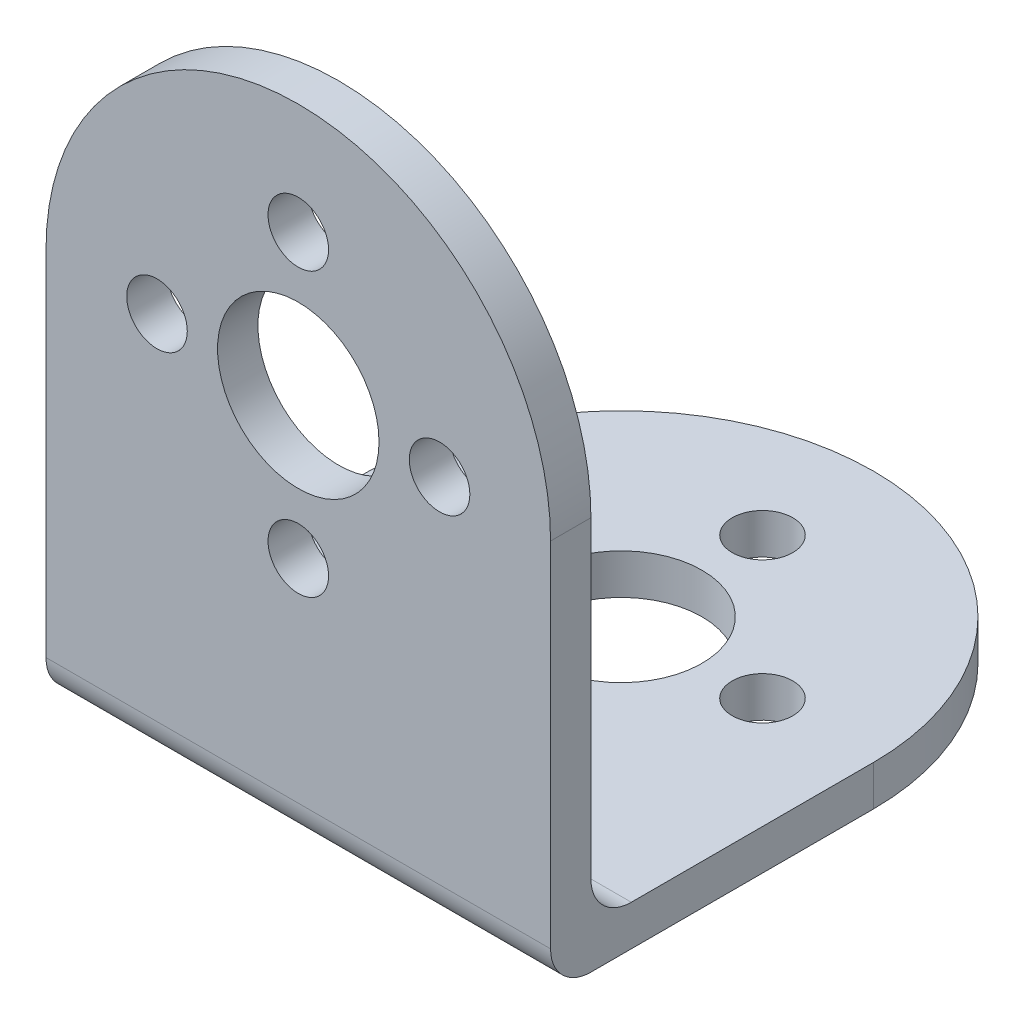
ISO-10303-21;
HEADER;
FILE_DESCRIPTION(('STEP AP214'),'2;1');
FILE_NAME('part.step','',(''),(''),'','','');
FILE_SCHEMA(('AUTOMOTIVE_DESIGN { 1 0 10303 214 1 1 1 1 }'));
ENDSEC;
DATA;
#1=APPLICATION_CONTEXT('core data for automotive mechanical design processes');
#2=APPLICATION_PROTOCOL_DEFINITION('international standard','automotive_design',2000,#1);
#3=PRODUCT_CONTEXT('',#1,'mechanical');
#4=PRODUCT('Part','Part','',(#3));
#5=PRODUCT_RELATED_PRODUCT_CATEGORY('part','',(#4));
#6=PRODUCT_DEFINITION_FORMATION('','',#4);
#7=PRODUCT_DEFINITION_CONTEXT('part definition',#1,'design');
#8=PRODUCT_DEFINITION('design','',#6,#7);
#9=PRODUCT_DEFINITION_SHAPE('','',#8);
#10=(LENGTH_UNIT() NAMED_UNIT(*) SI_UNIT(.MILLI.,.METRE.));
#11=(NAMED_UNIT(*) PLANE_ANGLE_UNIT() SI_UNIT($,.RADIAN.));
#12=(NAMED_UNIT(*) SI_UNIT($,.STERADIAN.) SOLID_ANGLE_UNIT());
#13=UNCERTAINTY_MEASURE_WITH_UNIT(LENGTH_MEASURE(1.E-05),#10,'distance_accuracy_value','');
#14=(GEOMETRIC_REPRESENTATION_CONTEXT(3) GLOBAL_UNCERTAINTY_ASSIGNED_CONTEXT((#13)) GLOBAL_UNIT_ASSIGNED_CONTEXT((#10,
#11,#12)) REPRESENTATION_CONTEXT('',''));
#15=CARTESIAN_POINT('',(0.,0.,0.));
#16=DIRECTION('',(0.,0.,1.));
#17=DIRECTION('',(1.,0.,0.));
#18=AXIS2_PLACEMENT_3D('',#15,#16,#17);
#19=CARTESIAN_POINT('',(0.,0.,-2.));
#20=DIRECTION('',(0.,0.,1.));
#21=DIRECTION('',(1.,0.,0.));
#22=AXIS2_PLACEMENT_3D('',#19,#20,#21);
#23=PLANE('',#22);
#24=CARTESIAN_POINT('',(0.,0.,-2.));
#25=DIRECTION('',(0.,0.,1.));
#26=DIRECTION('',(1.,0.,0.));
#27=AXIS2_PLACEMENT_3D('',#24,#25,#26);
#28=CIRCLE('',#27,4.);
#29=CARTESIAN_POINT('',(4.,0.,-2.));
#30=VERTEX_POINT('',#29);
#31=EDGE_CURVE('E162',#30,#30,#28,.T.);
#32=ORIENTED_EDGE('',*,*,#31,.T.);
#33=EDGE_LOOP('',(#32));
#34=FACE_BOUND('',#33,.T.);
#35=CARTESIAN_POINT('',(0.,7.,-2.));
#36=DIRECTION('',(0.,0.,1.));
#37=DIRECTION('',(1.,0.,0.));
#38=AXIS2_PLACEMENT_3D('',#35,#36,#37);
#39=CIRCLE('',#38,1.5);
#40=CARTESIAN_POINT('',(1.5,7.,-2.));
#41=VERTEX_POINT('',#40);
#42=EDGE_CURVE('E156',#41,#41,#39,.T.);
#43=ORIENTED_EDGE('',*,*,#42,.T.);
#44=EDGE_LOOP('',(#43));
#45=FACE_BOUND('',#44,.T.);
#46=CARTESIAN_POINT('',(7.,0.,-2.));
#47=DIRECTION('',(0.,0.,1.));
#48=DIRECTION('',(1.,0.,0.));
#49=AXIS2_PLACEMENT_3D('',#46,#47,#48);
#50=CIRCLE('',#49,1.5);
#51=CARTESIAN_POINT('',(8.5,0.,-2.));
#52=VERTEX_POINT('',#51);
#53=EDGE_CURVE('E150',#52,#52,#50,.T.);
#54=ORIENTED_EDGE('',*,*,#53,.T.);
#55=EDGE_LOOP('',(#54));
#56=FACE_BOUND('',#55,.T.);
#57=CARTESIAN_POINT('',(3.9618942650685E-13,-7.,-2.));
#58=DIRECTION('',(0.,0.,1.));
#59=DIRECTION('',(1.,0.,0.));
#60=AXIS2_PLACEMENT_3D('',#57,#58,#59);
#61=CIRCLE('',#60,1.50000000000043);
#62=CARTESIAN_POINT('',(1.50000000000082,-7.,-2.));
#63=VERTEX_POINT('',#62);
#64=EDGE_CURVE('E144',#63,#63,#61,.T.);
#65=ORIENTED_EDGE('',*,*,#64,.T.);
#66=EDGE_LOOP('',(#65));
#67=FACE_BOUND('',#66,.T.);
#68=CARTESIAN_POINT('',(-7.,0.,-2.));
#69=DIRECTION('',(0.,0.,1.));
#70=DIRECTION('',(1.,0.,0.));
#71=AXIS2_PLACEMENT_3D('',#68,#69,#70);
#72=CIRCLE('',#71,1.5);
#73=CARTESIAN_POINT('',(-5.5,0.,-2.));
#74=VERTEX_POINT('',#73);
#75=EDGE_CURVE('E138',#74,#74,#72,.T.);
#76=ORIENTED_EDGE('',*,*,#75,.T.);
#77=EDGE_LOOP('',(#76));
#78=FACE_BOUND('',#77,.T.);
#79=DIRECTION('',(0.,1.,0.));
#80=VECTOR('',#79,1.);
#81=CARTESIAN_POINT('',(12.5,-19.5,-2.));
#82=LINE('',#81,#80);
#83=CARTESIAN_POINT('',(12.5,-15.5,-2.));
#84=VERTEX_POINT('',#83);
#85=CARTESIAN_POINT('',(12.5,0.,-2.));
#86=VERTEX_POINT('',#85);
#87=EDGE_CURVE('E174',#84,#86,#82,.T.);
#88=ORIENTED_EDGE('',*,*,#87,.F.);
#89=DIRECTION('',(1.,0.,0.));
#90=VECTOR('',#89,1.);
#91=CARTESIAN_POINT('',(-12.5,-15.5,-2.));
#92=LINE('',#91,#90);
#93=CARTESIAN_POINT('',(-12.5,-15.5,-2.));
#94=VERTEX_POINT('',#93);
#95=EDGE_CURVE('E58',#84,#94,#92,.F.);
#96=ORIENTED_EDGE('',*,*,#95,.T.);
#97=DIRECTION('',(0.,-1.,0.));
#98=VECTOR('',#97,1.);
#99=CARTESIAN_POINT('',(-12.5,0.,-2.));
#100=LINE('',#99,#98);
#101=CARTESIAN_POINT('',(-12.5,0.,-2.));
#102=VERTEX_POINT('',#101);
#103=EDGE_CURVE('E171',#102,#94,#100,.T.);
#104=ORIENTED_EDGE('',*,*,#103,.F.);
#105=CARTESIAN_POINT('',(0.,0.,-2.));
#106=DIRECTION('',(0.,0.,1.));
#107=DIRECTION('',(1.,0.,0.));
#108=AXIS2_PLACEMENT_3D('',#105,#106,#107);
#109=CIRCLE('',#108,12.5);
#110=EDGE_CURVE('E168',#86,#102,#109,.T.);
#111=ORIENTED_EDGE('',*,*,#110,.F.);
#112=EDGE_LOOP('',(#88,#96,#104,#111));
#113=FACE_BOUND('',#112,.T.);
#114=ADVANCED_FACE('F37',(#34,#45,#56,#67,#78,#113),#23,.F.);
#115=CARTESIAN_POINT('',(0.,0.,-2.));
#116=DIRECTION('',(0.,0.,1.));
#117=DIRECTION('',(1.,0.,0.));
#118=AXIS2_PLACEMENT_3D('',#115,#116,#117);
#119=CYLINDRICAL_SURFACE('',#118,12.5);
#120=CARTESIAN_POINT('',(0.,0.,0.));
#121=DIRECTION('',(0.,0.,1.));
#122=DIRECTION('',(1.,0.,0.));
#123=AXIS2_PLACEMENT_3D('',#120,#121,#122);
#124=CIRCLE('',#123,12.5);
#125=CARTESIAN_POINT('',(12.5,0.,0.));
#126=VERTEX_POINT('',#125);
#127=CARTESIAN_POINT('',(-12.5,0.,0.));
#128=VERTEX_POINT('',#127);
#129=EDGE_CURVE('E165',#126,#128,#124,.T.);
#130=ORIENTED_EDGE('',*,*,#129,.F.);
#131=DIRECTION('',(0.,0.,1.));
#132=VECTOR('',#131,1.);
#133=CARTESIAN_POINT('',(12.5,0.,-2.));
#134=LINE('',#133,#132);
#135=EDGE_CURVE('E183',#86,#126,#134,.T.);
#136=ORIENTED_EDGE('',*,*,#135,.F.);
#137=ORIENTED_EDGE('',*,*,#110,.T.);
#138=DIRECTION('',(0.,0.,1.));
#139=VECTOR('',#138,1.);
#140=CARTESIAN_POINT('',(-12.5,0.,-2.));
#141=LINE('',#140,#139);
#142=EDGE_CURVE('E176',#102,#128,#141,.T.);
#143=ORIENTED_EDGE('',*,*,#142,.T.);
#144=EDGE_LOOP('',(#130,#136,#137,#143));
#145=FACE_BOUND('',#144,.T.);
#146=ADVANCED_FACE('F212',(#145),#119,.T.);
#147=CARTESIAN_POINT('',(12.5,-19.5,-2.));
#148=DIRECTION('',(1.,0.,0.));
#149=DIRECTION('',(0.,0.,-1.));
#150=AXIS2_PLACEMENT_3D('',#147,#148,#149);
#151=PLANE('',#150);
#152=DIRECTION('',(0.,1.,0.));
#153=VECTOR('',#152,1.);
#154=CARTESIAN_POINT('',(12.5,-19.5,0.));
#155=LINE('',#154,#153);
#156=CARTESIAN_POINT('',(12.5,-17.5,0.));
#157=VERTEX_POINT('',#156);
#158=EDGE_CURVE('E172',#157,#126,#155,.T.);
#159=ORIENTED_EDGE('',*,*,#158,.F.);
#160=CARTESIAN_POINT('',(12.5,-17.5,-2.));
#161=DIRECTION('',(1.,0.,0.));
#162=DIRECTION('',(0.,0.,-1.));
#163=AXIS2_PLACEMENT_3D('',#160,#161,#162);
#164=CIRCLE('',#163,2.);
#165=CARTESIAN_POINT('',(12.5,-19.5,-2.));
#166=VERTEX_POINT('',#165);
#167=EDGE_CURVE('E194',#157,#166,#164,.T.);
#168=ORIENTED_EDGE('',*,*,#167,.T.);
#169=DIRECTION('',(0.,0.,1.));
#170=VECTOR('',#169,1.);
#171=CARTESIAN_POINT('',(12.5,-19.5,-2.));
#172=LINE('',#171,#170);
#173=CARTESIAN_POINT('',(12.5,-19.5,-16.));
#174=VERTEX_POINT('',#173);
#175=EDGE_CURVE('E108',#174,#166,#172,.T.);
#176=ORIENTED_EDGE('',*,*,#175,.F.);
#177=DIRECTION('',(0.,-1.,0.));
#178=VECTOR('',#177,1.);
#179=CARTESIAN_POINT('',(12.5,-17.5,-16.));
#180=LINE('',#179,#178);
#181=CARTESIAN_POINT('',(12.5,-17.5,-16.));
#182=VERTEX_POINT('',#181);
#183=EDGE_CURVE('E102',#182,#174,#180,.T.);
#184=ORIENTED_EDGE('',*,*,#183,.F.);
#185=DIRECTION('',(0.,0.,1.));
#186=VECTOR('',#185,1.);
#187=CARTESIAN_POINT('',(12.5,-17.5,0.));
#188=LINE('',#187,#186);
#189=CARTESIAN_POINT('',(12.5,-17.5,-4.));
#190=VERTEX_POINT('',#189);
#191=EDGE_CURVE('E106',#182,#190,#188,.T.);
#192=ORIENTED_EDGE('',*,*,#191,.T.);
#193=CARTESIAN_POINT('',(12.5,-15.5,-4.));
#194=DIRECTION('',(1.,0.,0.));
#195=DIRECTION('',(0.,0.,-1.));
#196=AXIS2_PLACEMENT_3D('',#193,#194,#195);
#197=CIRCLE('',#196,2.);
#198=EDGE_CURVE('E45',#190,#84,#197,.F.);
#199=ORIENTED_EDGE('',*,*,#198,.T.);
#200=ORIENTED_EDGE('',*,*,#87,.T.);
#201=ORIENTED_EDGE('',*,*,#135,.T.);
#202=EDGE_LOOP('',(#159,#168,#176,#184,#192,#199,#200,#201));
#203=FACE_BOUND('',#202,.T.);
#204=ADVANCED_FACE('F105',(#203),#151,.T.);
#205=CARTESIAN_POINT('',(-12.5,-19.5,-2.));
#206=DIRECTION('',(0.,-1.,0.));
#207=DIRECTION('',(0.,0.,-1.));
#208=AXIS2_PLACEMENT_3D('',#205,#206,#207);
#209=PLANE('',#208);
#210=ORIENTED_EDGE('',*,*,#175,.T.);
#211=DIRECTION('',(1.,0.,0.));
#212=VECTOR('',#211,1.);
#213=CARTESIAN_POINT('',(-12.5,-19.5,-2.));
#214=LINE('',#213,#212);
#215=CARTESIAN_POINT('',(-12.5,-19.5,-2.));
#216=VERTEX_POINT('',#215);
#217=EDGE_CURVE('E196',#166,#216,#214,.F.);
#218=ORIENTED_EDGE('',*,*,#217,.T.);
#219=DIRECTION('',(0.,0.,1.));
#220=VECTOR('',#219,1.);
#221=CARTESIAN_POINT('',(-12.5,-19.5,-2.));
#222=LINE('',#221,#220);
#223=CARTESIAN_POINT('',(-12.5,-19.5,-16.));
#224=VERTEX_POINT('',#223);
#225=EDGE_CURVE('E188',#224,#216,#222,.T.);
#226=ORIENTED_EDGE('',*,*,#225,.F.);
#227=CARTESIAN_POINT('',(0.,-19.5,-16.));
#228=DIRECTION('',(0.,-1.,0.));
#229=DIRECTION('',(0.,0.,-1.));
#230=AXIS2_PLACEMENT_3D('',#227,#228,#229);
#231=CIRCLE('',#230,12.5);
#232=EDGE_CURVE('E127',#224,#174,#231,.T.);
#233=ORIENTED_EDGE('',*,*,#232,.T.);
#234=EDGE_LOOP('',(#210,#218,#226,#233));
#235=FACE_BOUND('',#234,.T.);
#236=CARTESIAN_POINT('',(0.,-19.5,-16.));
#237=DIRECTION('',(0.,-1.,0.));
#238=DIRECTION('',(0.,0.,-1.));
#239=AXIS2_PLACEMENT_3D('',#236,#237,#238);
#240=CIRCLE('',#239,4.);
#241=CARTESIAN_POINT('',(0.,-19.5,-20.));
#242=VERTEX_POINT('',#241);
#243=EDGE_CURVE('E132',#242,#242,#240,.T.);
#244=ORIENTED_EDGE('',*,*,#243,.F.);
#245=EDGE_LOOP('',(#244));
#246=FACE_BOUND('',#245,.T.);
#247=CARTESIAN_POINT('',(0.,-19.5,-9.));
#248=DIRECTION('',(0.,-1.,0.));
#249=DIRECTION('',(0.,0.,-1.));
#250=AXIS2_PLACEMENT_3D('',#247,#248,#249);
#251=CIRCLE('',#250,1.5);
#252=CARTESIAN_POINT('',(0.,-19.5,-10.5));
#253=VERTEX_POINT('',#252);
#254=EDGE_CURVE('E252',#253,#253,#251,.T.);
#255=ORIENTED_EDGE('',*,*,#254,.F.);
#256=EDGE_LOOP('',(#255));
#257=FACE_BOUND('',#256,.T.);
#258=CARTESIAN_POINT('',(7.0000000000001,-19.5,-15.9999999999999));
#259=DIRECTION('',(0.,-1.,0.));
#260=DIRECTION('',(0.,0.,-1.));
#261=AXIS2_PLACEMENT_3D('',#258,#259,#260);
#262=CIRCLE('',#261,1.5);
#263=CARTESIAN_POINT('',(7.0000000000001,-19.5,-17.4999999999999));
#264=VERTEX_POINT('',#263);
#265=EDGE_CURVE('E256',#264,#264,#262,.T.);
#266=ORIENTED_EDGE('',*,*,#265,.F.);
#267=EDGE_LOOP('',(#266));
#268=FACE_BOUND('',#267,.T.);
#269=CARTESIAN_POINT('',(1.49234192466792E-13,-19.5,-23.));
#270=DIRECTION('',(0.,-1.,0.));
#271=DIRECTION('',(0.,0.,-1.));
#272=AXIS2_PLACEMENT_3D('',#269,#270,#271);
#273=CIRCLE('',#272,1.5);
#274=CARTESIAN_POINT('',(1.49234192466792E-13,-19.5,-24.5));
#275=VERTEX_POINT('',#274);
#276=EDGE_CURVE('E260',#275,#275,#273,.T.);
#277=ORIENTED_EDGE('',*,*,#276,.F.);
#278=EDGE_LOOP('',(#277));
#279=FACE_BOUND('',#278,.T.);
#280=CARTESIAN_POINT('',(-6.9999999999999,-19.5,-16.));
#281=DIRECTION('',(0.,-1.,0.));
#282=DIRECTION('',(0.,0.,-1.));
#283=AXIS2_PLACEMENT_3D('',#280,#281,#282);
#284=CIRCLE('',#283,1.5);
#285=CARTESIAN_POINT('',(-6.9999999999999,-19.5,-17.5));
#286=VERTEX_POINT('',#285);
#287=EDGE_CURVE('E263',#286,#286,#284,.T.);
#288=ORIENTED_EDGE('',*,*,#287,.F.);
#289=EDGE_LOOP('',(#288));
#290=FACE_BOUND('',#289,.T.);
#291=ADVANCED_FACE('F232',(#235,#246,#257,#268,#279,#290),#209,.T.);
#292=CARTESIAN_POINT('',(-12.5,0.,-2.));
#293=DIRECTION('',(-1.,0.,0.));
#294=DIRECTION('',(0.,0.,1.));
#295=AXIS2_PLACEMENT_3D('',#292,#293,#294);
#296=PLANE('',#295);
#297=ORIENTED_EDGE('',*,*,#225,.T.);
#298=CARTESIAN_POINT('',(-12.5,-17.5,-2.));
#299=DIRECTION('',(-1.,0.,0.));
#300=DIRECTION('',(0.,0.,1.));
#301=AXIS2_PLACEMENT_3D('',#298,#299,#300);
#302=CIRCLE('',#301,2.);
#303=CARTESIAN_POINT('',(-12.5,-17.5,0.));
#304=VERTEX_POINT('',#303);
#305=EDGE_CURVE('E198',#216,#304,#302,.T.);
#306=ORIENTED_EDGE('',*,*,#305,.T.);
#307=DIRECTION('',(0.,-1.,0.));
#308=VECTOR('',#307,1.);
#309=CARTESIAN_POINT('',(-12.5,0.,0.));
#310=LINE('',#309,#308);
#311=EDGE_CURVE('E179',#128,#304,#310,.T.);
#312=ORIENTED_EDGE('',*,*,#311,.F.);
#313=ORIENTED_EDGE('',*,*,#142,.F.);
#314=ORIENTED_EDGE('',*,*,#103,.T.);
#315=CARTESIAN_POINT('',(-12.5,-15.5,-4.));
#316=DIRECTION('',(-1.,0.,0.));
#317=DIRECTION('',(0.,0.,1.));
#318=AXIS2_PLACEMENT_3D('',#315,#316,#317);
#319=CIRCLE('',#318,2.);
#320=CARTESIAN_POINT('',(-12.5,-17.5,-4.));
#321=VERTEX_POINT('',#320);
#322=EDGE_CURVE('E11',#94,#321,#319,.F.);
#323=ORIENTED_EDGE('',*,*,#322,.T.);
#324=DIRECTION('',(0.,0.,-1.));
#325=VECTOR('',#324,1.);
#326=CARTESIAN_POINT('',(-12.5,-17.5,-16.));
#327=LINE('',#326,#325);
#328=CARTESIAN_POINT('',(-12.5,-17.5,-16.));
#329=VERTEX_POINT('',#328);
#330=EDGE_CURVE('E114',#321,#329,#327,.T.);
#331=ORIENTED_EDGE('',*,*,#330,.T.);
#332=DIRECTION('',(0.,-1.,0.));
#333=VECTOR('',#332,1.);
#334=CARTESIAN_POINT('',(-12.5,-17.5,-16.));
#335=LINE('',#334,#333);
#336=EDGE_CURVE('E113',#329,#224,#335,.T.);
#337=ORIENTED_EDGE('',*,*,#336,.T.);
#338=EDGE_LOOP('',(#297,#306,#312,#313,#314,#323,#331,#337));
#339=FACE_BOUND('',#338,.T.);
#340=ADVANCED_FACE('F228',(#339),#296,.T.);
#341=CARTESIAN_POINT('',(0.,0.,0.));
#342=DIRECTION('',(0.,0.,1.));
#343=DIRECTION('',(1.,0.,0.));
#344=AXIS2_PLACEMENT_3D('',#341,#342,#343);
#345=PLANE('',#344);
#346=ORIENTED_EDGE('',*,*,#311,.T.);
#347=DIRECTION('',(1.,0.,0.));
#348=VECTOR('',#347,1.);
#349=CARTESIAN_POINT('',(0.,-17.5,0.));
#350=LINE('',#349,#348);
#351=EDGE_CURVE('E186',#304,#157,#350,.T.);
#352=ORIENTED_EDGE('',*,*,#351,.T.);
#353=ORIENTED_EDGE('',*,*,#158,.T.);
#354=ORIENTED_EDGE('',*,*,#129,.T.);
#355=EDGE_LOOP('',(#346,#352,#353,#354));
#356=FACE_BOUND('',#355,.T.);
#357=CARTESIAN_POINT('',(-7.,0.,0.));
#358=DIRECTION('',(0.,0.,1.));
#359=DIRECTION('',(1.,0.,0.));
#360=AXIS2_PLACEMENT_3D('',#357,#358,#359);
#361=CIRCLE('',#360,1.5);
#362=CARTESIAN_POINT('',(-5.5,0.,0.));
#363=VERTEX_POINT('',#362);
#364=EDGE_CURVE('E136',#363,#363,#361,.T.);
#365=ORIENTED_EDGE('',*,*,#364,.F.);
#366=EDGE_LOOP('',(#365));
#367=FACE_BOUND('',#366,.T.);
#368=CARTESIAN_POINT('',(3.9618942650685E-13,-7.,0.));
#369=DIRECTION('',(0.,0.,1.));
#370=DIRECTION('',(1.,0.,0.));
#371=AXIS2_PLACEMENT_3D('',#368,#369,#370);
#372=CIRCLE('',#371,1.50000000000043);
#373=CARTESIAN_POINT('',(1.50000000000082,-7.,0.));
#374=VERTEX_POINT('',#373);
#375=EDGE_CURVE('E141',#374,#374,#372,.T.);
#376=ORIENTED_EDGE('',*,*,#375,.F.);
#377=EDGE_LOOP('',(#376));
#378=FACE_BOUND('',#377,.T.);
#379=CARTESIAN_POINT('',(7.,0.,0.));
#380=DIRECTION('',(0.,0.,1.));
#381=DIRECTION('',(1.,0.,0.));
#382=AXIS2_PLACEMENT_3D('',#379,#380,#381);
#383=CIRCLE('',#382,1.5);
#384=CARTESIAN_POINT('',(8.5,0.,0.));
#385=VERTEX_POINT('',#384);
#386=EDGE_CURVE('E147',#385,#385,#383,.T.);
#387=ORIENTED_EDGE('',*,*,#386,.F.);
#388=EDGE_LOOP('',(#387));
#389=FACE_BOUND('',#388,.T.);
#390=CARTESIAN_POINT('',(0.,7.,0.));
#391=DIRECTION('',(0.,0.,1.));
#392=DIRECTION('',(1.,0.,0.));
#393=AXIS2_PLACEMENT_3D('',#390,#391,#392);
#394=CIRCLE('',#393,1.5);
#395=CARTESIAN_POINT('',(1.5,7.,0.));
#396=VERTEX_POINT('',#395);
#397=EDGE_CURVE('E153',#396,#396,#394,.T.);
#398=ORIENTED_EDGE('',*,*,#397,.F.);
#399=EDGE_LOOP('',(#398));
#400=FACE_BOUND('',#399,.T.);
#401=CARTESIAN_POINT('',(0.,0.,0.));
#402=DIRECTION('',(0.,0.,1.));
#403=DIRECTION('',(1.,0.,0.));
#404=AXIS2_PLACEMENT_3D('',#401,#402,#403);
#405=CIRCLE('',#404,4.);
#406=CARTESIAN_POINT('',(4.,0.,0.));
#407=VERTEX_POINT('',#406);
#408=EDGE_CURVE('E159',#407,#407,#405,.T.);
#409=ORIENTED_EDGE('',*,*,#408,.F.);
#410=EDGE_LOOP('',(#409));
#411=FACE_BOUND('',#410,.T.);
#412=ADVANCED_FACE('F225',(#356,#367,#378,#389,#400,#411),#345,.T.);
#413=CARTESIAN_POINT('',(0.,0.,-2.));
#414=DIRECTION('',(0.,0.,1.));
#415=DIRECTION('',(1.,0.,0.));
#416=AXIS2_PLACEMENT_3D('',#413,#414,#415);
#417=CYLINDRICAL_SURFACE('',#416,4.);
#418=ORIENTED_EDGE('',*,*,#31,.F.);
#419=EDGE_LOOP('',(#418));
#420=FACE_BOUND('',#419,.T.);
#421=ORIENTED_EDGE('',*,*,#408,.T.);
#422=EDGE_LOOP('',(#421));
#423=FACE_BOUND('',#422,.T.);
#424=ADVANCED_FACE('F223',(#420,#423),#417,.F.);
#425=CARTESIAN_POINT('',(0.,7.,-2.));
#426=DIRECTION('',(0.,0.,1.));
#427=DIRECTION('',(1.,0.,0.));
#428=AXIS2_PLACEMENT_3D('',#425,#426,#427);
#429=CYLINDRICAL_SURFACE('',#428,1.5);
#430=ORIENTED_EDGE('',*,*,#42,.F.);
#431=EDGE_LOOP('',(#430));
#432=FACE_BOUND('',#431,.T.);
#433=ORIENTED_EDGE('',*,*,#397,.T.);
#434=EDGE_LOOP('',(#433));
#435=FACE_BOUND('',#434,.T.);
#436=ADVANCED_FACE('F313',(#432,#435),#429,.F.);
#437=CARTESIAN_POINT('',(7.,0.,-2.));
#438=DIRECTION('',(0.,0.,1.));
#439=DIRECTION('',(1.,0.,0.));
#440=AXIS2_PLACEMENT_3D('',#437,#438,#439);
#441=CYLINDRICAL_SURFACE('',#440,1.5);
#442=ORIENTED_EDGE('',*,*,#53,.F.);
#443=EDGE_LOOP('',(#442));
#444=FACE_BOUND('',#443,.T.);
#445=ORIENTED_EDGE('',*,*,#386,.T.);
#446=EDGE_LOOP('',(#445));
#447=FACE_BOUND('',#446,.T.);
#448=ADVANCED_FACE('F310',(#444,#447),#441,.F.);
#449=CARTESIAN_POINT('',(3.9618942650685E-13,-7.,-2.));
#450=DIRECTION('',(0.,0.,1.));
#451=DIRECTION('',(1.,0.,0.));
#452=AXIS2_PLACEMENT_3D('',#449,#450,#451);
#453=CYLINDRICAL_SURFACE('',#452,1.50000000000043);
#454=ORIENTED_EDGE('',*,*,#64,.F.);
#455=EDGE_LOOP('',(#454));
#456=FACE_BOUND('',#455,.T.);
#457=ORIENTED_EDGE('',*,*,#375,.T.);
#458=EDGE_LOOP('',(#457));
#459=FACE_BOUND('',#458,.T.);
#460=ADVANCED_FACE('F306',(#456,#459),#453,.F.);
#461=CARTESIAN_POINT('',(-7.,0.,-2.));
#462=DIRECTION('',(0.,0.,1.));
#463=DIRECTION('',(1.,0.,0.));
#464=AXIS2_PLACEMENT_3D('',#461,#462,#463);
#465=CYLINDRICAL_SURFACE('',#464,1.5);
#466=ORIENTED_EDGE('',*,*,#75,.F.);
#467=EDGE_LOOP('',(#466));
#468=FACE_BOUND('',#467,.T.);
#469=ORIENTED_EDGE('',*,*,#364,.T.);
#470=EDGE_LOOP('',(#469));
#471=FACE_BOUND('',#470,.T.);
#472=ADVANCED_FACE('F301',(#468,#471),#465,.F.);
#473=CARTESIAN_POINT('',(0.,-17.5,-16.));
#474=DIRECTION('',(0.,-1.,0.));
#475=DIRECTION('',(0.,0.,-1.));
#476=AXIS2_PLACEMENT_3D('',#473,#474,#475);
#477=PLANE('',#476);
#478=CARTESIAN_POINT('',(-6.9999999999999,-17.5,-16.));
#479=DIRECTION('',(0.,-1.,0.));
#480=DIRECTION('',(0.,0.,-1.));
#481=AXIS2_PLACEMENT_3D('',#478,#479,#480);
#482=CIRCLE('',#481,1.5);
#483=CARTESIAN_POINT('',(-6.9999999999999,-17.5,-17.5));
#484=VERTEX_POINT('',#483);
#485=EDGE_CURVE('E265',#484,#484,#482,.T.);
#486=ORIENTED_EDGE('',*,*,#485,.T.);
#487=EDGE_LOOP('',(#486));
#488=FACE_BOUND('',#487,.T.);
#489=CARTESIAN_POINT('',(1.49234192466792E-13,-17.5,-23.));
#490=DIRECTION('',(0.,-1.,0.));
#491=DIRECTION('',(0.,0.,-1.));
#492=AXIS2_PLACEMENT_3D('',#489,#490,#491);
#493=CIRCLE('',#492,1.5);
#494=CARTESIAN_POINT('',(1.49234192466792E-13,-17.5,-24.5));
#495=VERTEX_POINT('',#494);
#496=EDGE_CURVE('E270',#495,#495,#493,.T.);
#497=ORIENTED_EDGE('',*,*,#496,.T.);
#498=EDGE_LOOP('',(#497));
#499=FACE_BOUND('',#498,.T.);
#500=CARTESIAN_POINT('',(7.0000000000001,-17.5,-15.9999999999999));
#501=DIRECTION('',(0.,-1.,0.));
#502=DIRECTION('',(0.,0.,-1.));
#503=AXIS2_PLACEMENT_3D('',#500,#501,#502);
#504=CIRCLE('',#503,1.5);
#505=CARTESIAN_POINT('',(7.0000000000001,-17.5,-17.4999999999999));
#506=VERTEX_POINT('',#505);
#507=EDGE_CURVE('E274',#506,#506,#504,.T.);
#508=ORIENTED_EDGE('',*,*,#507,.T.);
#509=EDGE_LOOP('',(#508));
#510=FACE_BOUND('',#509,.T.);
#511=CARTESIAN_POINT('',(0.,-17.5,-9.));
#512=DIRECTION('',(0.,-1.,0.));
#513=DIRECTION('',(0.,0.,-1.));
#514=AXIS2_PLACEMENT_3D('',#511,#512,#513);
#515=CIRCLE('',#514,1.5);
#516=CARTESIAN_POINT('',(0.,-17.5,-10.5));
#517=VERTEX_POINT('',#516);
#518=EDGE_CURVE('E278',#517,#517,#515,.T.);
#519=ORIENTED_EDGE('',*,*,#518,.T.);
#520=EDGE_LOOP('',(#519));
#521=FACE_BOUND('',#520,.T.);
#522=CARTESIAN_POINT('',(0.,-17.5,-16.));
#523=DIRECTION('',(0.,-1.,0.));
#524=DIRECTION('',(0.,0.,-1.));
#525=AXIS2_PLACEMENT_3D('',#522,#523,#524);
#526=CIRCLE('',#525,4.);
#527=CARTESIAN_POINT('',(0.,-17.5,-20.));
#528=VERTEX_POINT('',#527);
#529=EDGE_CURVE('E129',#528,#528,#526,.T.);
#530=ORIENTED_EDGE('',*,*,#529,.T.);
#531=EDGE_LOOP('',(#530));
#532=FACE_BOUND('',#531,.T.);
#533=ORIENTED_EDGE('',*,*,#330,.F.);
#534=DIRECTION('',(1.,0.,0.));
#535=VECTOR('',#534,1.);
#536=CARTESIAN_POINT('',(12.5,-17.5,-4.));
#537=LINE('',#536,#535);
#538=EDGE_CURVE('E122',#321,#190,#537,.T.);
#539=ORIENTED_EDGE('',*,*,#538,.T.);
#540=ORIENTED_EDGE('',*,*,#191,.F.);
#541=CARTESIAN_POINT('',(0.,-17.5,-16.));
#542=DIRECTION('',(0.,-1.,0.));
#543=DIRECTION('',(0.,0.,-1.));
#544=AXIS2_PLACEMENT_3D('',#541,#542,#543);
#545=CIRCLE('',#544,12.5);
#546=EDGE_CURVE('E120',#329,#182,#545,.T.);
#547=ORIENTED_EDGE('',*,*,#546,.F.);
#548=EDGE_LOOP('',(#533,#539,#540,#547));
#549=FACE_BOUND('',#548,.T.);
#550=ADVANCED_FACE('F119',(#488,#499,#510,#521,#532,#549),#477,.F.);
#551=CARTESIAN_POINT('',(0.,-17.5,-16.));
#552=DIRECTION('',(0.,-1.,0.));
#553=DIRECTION('',(0.,0.,-1.));
#554=AXIS2_PLACEMENT_3D('',#551,#552,#553);
#555=CYLINDRICAL_SURFACE('',#554,12.5);
#556=ORIENTED_EDGE('',*,*,#232,.F.);
#557=ORIENTED_EDGE('',*,*,#336,.F.);
#558=ORIENTED_EDGE('',*,*,#546,.T.);
#559=ORIENTED_EDGE('',*,*,#183,.T.);
#560=EDGE_LOOP('',(#556,#557,#558,#559));
#561=FACE_BOUND('',#560,.T.);
#562=ADVANCED_FACE('F125',(#561),#555,.T.);
#563=CARTESIAN_POINT('',(0.,-17.5,-16.));
#564=DIRECTION('',(0.,-1.,0.));
#565=DIRECTION('',(0.,0.,-1.));
#566=AXIS2_PLACEMENT_3D('',#563,#564,#565);
#567=CYLINDRICAL_SURFACE('',#566,4.);
#568=ORIENTED_EDGE('',*,*,#529,.F.);
#569=EDGE_LOOP('',(#568));
#570=FACE_BOUND('',#569,.T.);
#571=ORIENTED_EDGE('',*,*,#243,.T.);
#572=EDGE_LOOP('',(#571));
#573=FACE_BOUND('',#572,.T.);
#574=ADVANCED_FACE('F285',(#570,#573),#567,.F.);
#575=CARTESIAN_POINT('',(0.,-17.5,-9.));
#576=DIRECTION('',(0.,-1.,0.));
#577=DIRECTION('',(0.,0.,-1.));
#578=AXIS2_PLACEMENT_3D('',#575,#576,#577);
#579=CYLINDRICAL_SURFACE('',#578,1.5);
#580=ORIENTED_EDGE('',*,*,#518,.F.);
#581=EDGE_LOOP('',(#580));
#582=FACE_BOUND('',#581,.T.);
#583=ORIENTED_EDGE('',*,*,#254,.T.);
#584=EDGE_LOOP('',(#583));
#585=FACE_BOUND('',#584,.T.);
#586=ADVANCED_FACE('F287',(#582,#585),#579,.F.);
#587=CARTESIAN_POINT('',(7.0000000000001,-17.5,-15.9999999999999));
#588=DIRECTION('',(0.,-1.,0.));
#589=DIRECTION('',(0.,0.,-1.));
#590=AXIS2_PLACEMENT_3D('',#587,#588,#589);
#591=CYLINDRICAL_SURFACE('',#590,1.5);
#592=ORIENTED_EDGE('',*,*,#507,.F.);
#593=EDGE_LOOP('',(#592));
#594=FACE_BOUND('',#593,.T.);
#595=ORIENTED_EDGE('',*,*,#265,.T.);
#596=EDGE_LOOP('',(#595));
#597=FACE_BOUND('',#596,.T.);
#598=ADVANCED_FACE('F294',(#594,#597),#591,.F.);
#599=CARTESIAN_POINT('',(1.49234192466792E-13,-17.5,-23.));
#600=DIRECTION('',(0.,-1.,0.));
#601=DIRECTION('',(0.,0.,-1.));
#602=AXIS2_PLACEMENT_3D('',#599,#600,#601);
#603=CYLINDRICAL_SURFACE('',#602,1.5);
#604=ORIENTED_EDGE('',*,*,#496,.F.);
#605=EDGE_LOOP('',(#604));
#606=FACE_BOUND('',#605,.T.);
#607=ORIENTED_EDGE('',*,*,#276,.T.);
#608=EDGE_LOOP('',(#607));
#609=FACE_BOUND('',#608,.T.);
#610=ADVANCED_FACE('F380',(#606,#609),#603,.F.);
#611=CARTESIAN_POINT('',(-6.9999999999999,-17.5,-16.));
#612=DIRECTION('',(0.,-1.,0.));
#613=DIRECTION('',(0.,0.,-1.));
#614=AXIS2_PLACEMENT_3D('',#611,#612,#613);
#615=CYLINDRICAL_SURFACE('',#614,1.5);
#616=ORIENTED_EDGE('',*,*,#485,.F.);
#617=EDGE_LOOP('',(#616));
#618=FACE_BOUND('',#617,.T.);
#619=ORIENTED_EDGE('',*,*,#287,.T.);
#620=EDGE_LOOP('',(#619));
#621=FACE_BOUND('',#620,.T.);
#622=ADVANCED_FACE('F209',(#618,#621),#615,.F.);
#623=CARTESIAN_POINT('',(0.,-17.5,-2.));
#624=DIRECTION('',(1.,0.,0.));
#625=DIRECTION('',(0.,0.,-1.));
#626=AXIS2_PLACEMENT_3D('',#623,#624,#625);
#627=CYLINDRICAL_SURFACE('',#626,2.);
#628=ORIENTED_EDGE('',*,*,#305,.F.);
#629=ORIENTED_EDGE('',*,*,#217,.F.);
#630=ORIENTED_EDGE('',*,*,#167,.F.);
#631=ORIENTED_EDGE('',*,*,#351,.F.);
#632=EDGE_LOOP('',(#628,#629,#630,#631));
#633=FACE_BOUND('',#632,.T.);
#634=ADVANCED_FACE('F205',(#633),#627,.T.);
#635=CARTESIAN_POINT('',(0.,-15.5,-4.));
#636=DIRECTION('',(-1.,0.,0.));
#637=DIRECTION('',(0.,0.,1.));
#638=AXIS2_PLACEMENT_3D('',#635,#636,#637);
#639=CYLINDRICAL_SURFACE('',#638,2.);
#640=ORIENTED_EDGE('',*,*,#322,.F.);
#641=ORIENTED_EDGE('',*,*,#95,.F.);
#642=ORIENTED_EDGE('',*,*,#198,.F.);
#643=ORIENTED_EDGE('',*,*,#538,.F.);
#644=EDGE_LOOP('',(#640,#641,#642,#643));
#645=FACE_BOUND('',#644,.T.);
#646=ADVANCED_FACE('F39',(#645),#639,.F.);
#647=CLOSED_SHELL('',(#114,#146,#204,#291,#340,#412,#424,#436,#448,#460,#472,#550,#562,#574,
#586,#598,#610,#622,#634,#646));
#648=MANIFOLD_SOLID_BREP('B2',#647);
#649=ADVANCED_BREP_SHAPE_REPRESENTATION('',(#18,#648),#14);
#650=SHAPE_DEFINITION_REPRESENTATION(#9,#649);
ENDSEC;
END-ISO-10303-21;
